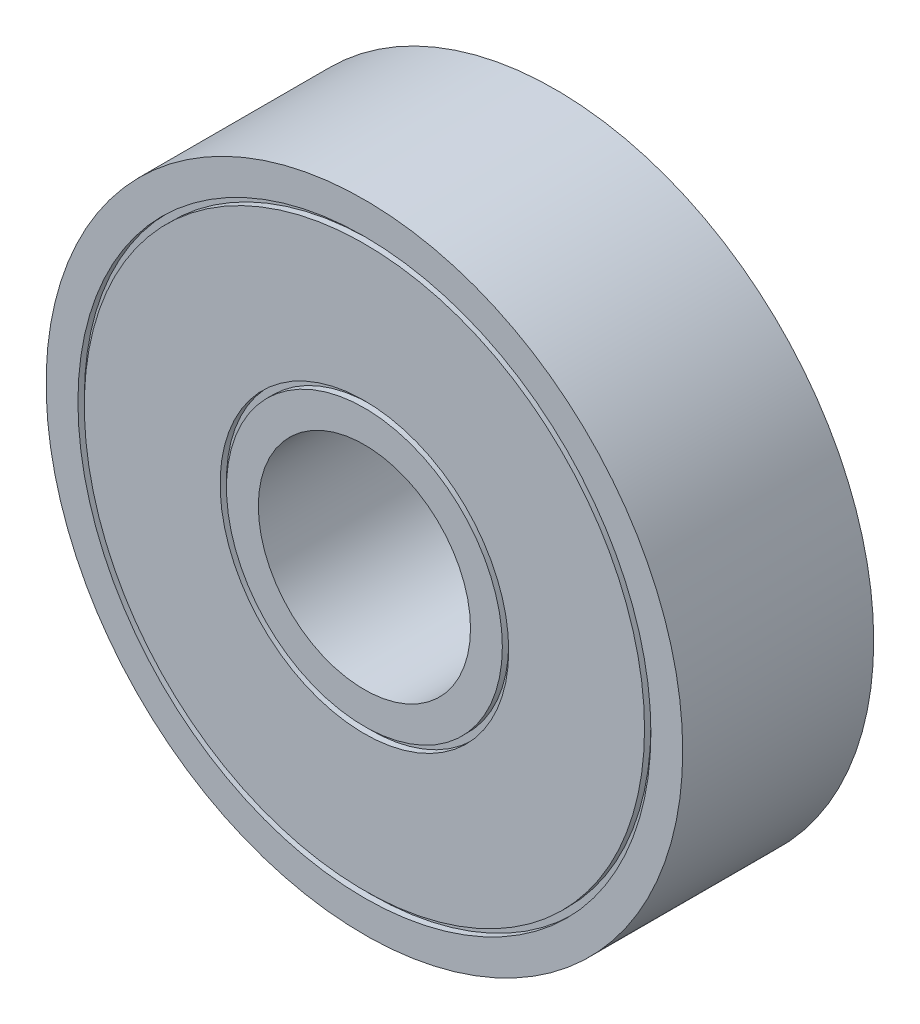
ISO-10303-21;
HEADER;
FILE_DESCRIPTION(('STEP AP214'),'2;1');
FILE_NAME('part.step','',(''),(''),'','','');
FILE_SCHEMA(('AUTOMOTIVE_DESIGN { 1 0 10303 214 1 1 1 1 }'));
ENDSEC;
DATA;
#1=APPLICATION_CONTEXT('core data for automotive mechanical design processes');
#2=APPLICATION_PROTOCOL_DEFINITION('international standard','automotive_design',2000,#1);
#3=PRODUCT_CONTEXT('',#1,'mechanical');
#4=PRODUCT('Part','Part','',(#3));
#5=PRODUCT_RELATED_PRODUCT_CATEGORY('part','',(#4));
#6=PRODUCT_DEFINITION_FORMATION('','',#4);
#7=PRODUCT_DEFINITION_CONTEXT('part definition',#1,'design');
#8=PRODUCT_DEFINITION('design','',#6,#7);
#9=PRODUCT_DEFINITION_SHAPE('','',#8);
#10=(LENGTH_UNIT() NAMED_UNIT(*) SI_UNIT(.MILLI.,.METRE.));
#11=(NAMED_UNIT(*) PLANE_ANGLE_UNIT() SI_UNIT($,.RADIAN.));
#12=(NAMED_UNIT(*) SI_UNIT($,.STERADIAN.) SOLID_ANGLE_UNIT());
#13=UNCERTAINTY_MEASURE_WITH_UNIT(LENGTH_MEASURE(1.E-05),#10,'distance_accuracy_value','');
#14=(GEOMETRIC_REPRESENTATION_CONTEXT(3) GLOBAL_UNCERTAINTY_ASSIGNED_CONTEXT((#13)) GLOBAL_UNIT_ASSIGNED_CONTEXT((#10,
#11,#12)) REPRESENTATION_CONTEXT('',''));
#15=CARTESIAN_POINT('',(0.,0.,0.));
#16=DIRECTION('',(0.,0.,1.));
#17=DIRECTION('',(1.,0.,0.));
#18=AXIS2_PLACEMENT_3D('',#15,#16,#17);
#19=CARTESIAN_POINT('',(0.,0.,0.));
#20=DIRECTION('',(0.,0.,1.));
#21=DIRECTION('',(1.,0.,0.));
#22=AXIS2_PLACEMENT_3D('',#19,#20,#21);
#23=PLANE('',#22);
#24=CARTESIAN_POINT('',(0.,0.,0.));
#25=DIRECTION('',(0.,0.,1.));
#26=DIRECTION('',(1.,0.,0.));
#27=AXIS2_PLACEMENT_3D('',#24,#25,#26);
#28=CIRCLE('',#27,5.);
#29=CARTESIAN_POINT('',(5.,0.,0.));
#30=VERTEX_POINT('',#29);
#31=EDGE_CURVE('E57',#30,#30,#28,.T.);
#32=ORIENTED_EDGE('',*,*,#31,.T.);
#33=EDGE_LOOP('',(#32));
#34=FACE_BOUND('',#33,.T.);
#35=CARTESIAN_POINT('',(0.,0.,0.));
#36=DIRECTION('',(0.,0.,1.));
#37=DIRECTION('',(1.,0.,0.));
#38=AXIS2_PLACEMENT_3D('',#35,#36,#37);
#39=CIRCLE('',#38,6.5);
#40=CARTESIAN_POINT('',(6.5,0.,0.));
#41=VERTEX_POINT('',#40);
#42=EDGE_CURVE('E103',#41,#41,#39,.T.);
#43=ORIENTED_EDGE('',*,*,#42,.F.);
#44=EDGE_LOOP('',(#43));
#45=FACE_BOUND('',#44,.T.);
#46=ADVANCED_FACE('F44',(#34,#45),#23,.F.);
#47=CARTESIAN_POINT('',(0.,0.,0.));
#48=DIRECTION('',(0.,0.,1.));
#49=DIRECTION('',(1.,0.,0.));
#50=AXIS2_PLACEMENT_3D('',#47,#48,#49);
#51=CIRCLE('',#50,6.8);
#52=CARTESIAN_POINT('',(6.8,0.,0.));
#53=VERTEX_POINT('',#52);
#54=EDGE_CURVE('E99',#53,#53,#51,.T.);
#55=ORIENTED_EDGE('',*,*,#54,.T.);
#56=EDGE_LOOP('',(#55));
#57=FACE_BOUND('',#56,.T.);
#58=CARTESIAN_POINT('',(0.,0.,0.));
#59=DIRECTION('',(0.,0.,1.));
#60=DIRECTION('',(1.,0.,0.));
#61=AXIS2_PLACEMENT_3D('',#58,#59,#60);
#62=CIRCLE('',#61,13.2);
#63=CARTESIAN_POINT('',(13.2,0.,0.));
#64=VERTEX_POINT('',#63);
#65=EDGE_CURVE('E91',#64,#64,#62,.T.);
#66=ORIENTED_EDGE('',*,*,#65,.F.);
#67=EDGE_LOOP('',(#66));
#68=FACE_BOUND('',#67,.T.);
#69=ADVANCED_FACE('F123',(#57,#68),#23,.F.);
#70=CARTESIAN_POINT('',(0.,0.,9.));
#71=DIRECTION('',(0.,0.,1.));
#72=DIRECTION('',(1.,0.,0.));
#73=AXIS2_PLACEMENT_3D('',#70,#71,#72);
#74=PLANE('',#73);
#75=CARTESIAN_POINT('',(0.,0.,9.));
#76=DIRECTION('',(0.,0.,1.));
#77=DIRECTION('',(1.,0.,0.));
#78=AXIS2_PLACEMENT_3D('',#75,#76,#77);
#79=CIRCLE('',#78,5.);
#80=CARTESIAN_POINT('',(5.,0.,9.));
#81=VERTEX_POINT('',#80);
#82=EDGE_CURVE('E55',#81,#81,#79,.T.);
#83=ORIENTED_EDGE('',*,*,#82,.F.);
#84=EDGE_LOOP('',(#83));
#85=FACE_BOUND('',#84,.T.);
#86=CARTESIAN_POINT('',(0.,0.,9.));
#87=DIRECTION('',(0.,0.,1.));
#88=DIRECTION('',(1.,0.,0.));
#89=AXIS2_PLACEMENT_3D('',#86,#87,#88);
#90=CIRCLE('',#89,6.5);
#91=CARTESIAN_POINT('',(6.5,0.,9.));
#92=VERTEX_POINT('',#91);
#93=EDGE_CURVE('E79',#92,#92,#90,.T.);
#94=ORIENTED_EDGE('',*,*,#93,.T.);
#95=EDGE_LOOP('',(#94));
#96=FACE_BOUND('',#95,.T.);
#97=ADVANCED_FACE('F129',(#85,#96),#74,.T.);
#98=CARTESIAN_POINT('',(0.,0.,9.));
#99=DIRECTION('',(0.,0.,1.));
#100=DIRECTION('',(1.,0.,0.));
#101=AXIS2_PLACEMENT_3D('',#98,#99,#100);
#102=CIRCLE('',#101,6.8);
#103=CARTESIAN_POINT('',(6.8,0.,9.));
#104=VERTEX_POINT('',#103);
#105=EDGE_CURVE('E75',#104,#104,#102,.T.);
#106=ORIENTED_EDGE('',*,*,#105,.F.);
#107=EDGE_LOOP('',(#106));
#108=FACE_BOUND('',#107,.T.);
#109=CARTESIAN_POINT('',(0.,0.,9.));
#110=DIRECTION('',(0.,0.,1.));
#111=DIRECTION('',(1.,0.,0.));
#112=AXIS2_PLACEMENT_3D('',#109,#110,#111);
#113=CIRCLE('',#112,13.2);
#114=CARTESIAN_POINT('',(13.2,0.,9.));
#115=VERTEX_POINT('',#114);
#116=EDGE_CURVE('E67',#115,#115,#113,.T.);
#117=ORIENTED_EDGE('',*,*,#116,.T.);
#118=EDGE_LOOP('',(#117));
#119=FACE_BOUND('',#118,.T.);
#120=ADVANCED_FACE('F141',(#108,#119),#74,.T.);
#121=CARTESIAN_POINT('',(0.,0.,9.));
#122=DIRECTION('',(0.,0.,1.));
#123=DIRECTION('',(1.,0.,0.));
#124=AXIS2_PLACEMENT_3D('',#121,#122,#123);
#125=CIRCLE('',#124,13.5);
#126=CARTESIAN_POINT('',(13.5,0.,9.));
#127=VERTEX_POINT('',#126);
#128=EDGE_CURVE('E63',#127,#127,#125,.T.);
#129=ORIENTED_EDGE('',*,*,#128,.F.);
#130=EDGE_LOOP('',(#129));
#131=FACE_BOUND('',#130,.T.);
#132=CARTESIAN_POINT('',(0.,0.,9.));
#133=DIRECTION('',(0.,0.,1.));
#134=DIRECTION('',(1.,0.,0.));
#135=AXIS2_PLACEMENT_3D('',#132,#133,#134);
#136=CIRCLE('',#135,15.);
#137=CARTESIAN_POINT('',(15.,0.,9.));
#138=VERTEX_POINT('',#137);
#139=EDGE_CURVE('E11',#138,#138,#136,.T.);
#140=ORIENTED_EDGE('',*,*,#139,.T.);
#141=EDGE_LOOP('',(#140));
#142=FACE_BOUND('',#141,.T.);
#143=ADVANCED_FACE('F133',(#131,#142),#74,.T.);
#144=CARTESIAN_POINT('',(0.,0.,0.));
#145=DIRECTION('',(0.,0.,1.));
#146=DIRECTION('',(1.,0.,0.));
#147=AXIS2_PLACEMENT_3D('',#144,#145,#146);
#148=CIRCLE('',#147,13.5);
#149=CARTESIAN_POINT('',(13.5,0.,0.));
#150=VERTEX_POINT('',#149);
#151=EDGE_CURVE('E87',#150,#150,#148,.T.);
#152=ORIENTED_EDGE('',*,*,#151,.T.);
#153=EDGE_LOOP('',(#152));
#154=FACE_BOUND('',#153,.T.);
#155=CARTESIAN_POINT('',(0.,0.,0.));
#156=DIRECTION('',(0.,0.,1.));
#157=DIRECTION('',(1.,0.,0.));
#158=AXIS2_PLACEMENT_3D('',#155,#156,#157);
#159=CIRCLE('',#158,15.);
#160=CARTESIAN_POINT('',(15.,0.,0.));
#161=VERTEX_POINT('',#160);
#162=EDGE_CURVE('E48',#161,#161,#159,.T.);
#163=ORIENTED_EDGE('',*,*,#162,.F.);
#164=EDGE_LOOP('',(#163));
#165=FACE_BOUND('',#164,.T.);
#166=ADVANCED_FACE('F125',(#154,#165),#23,.F.);
#167=CARTESIAN_POINT('',(0.,0.,9.));
#168=DIRECTION('',(0.,0.,-1.));
#169=DIRECTION('',(-1.,0.,0.));
#170=AXIS2_PLACEMENT_3D('',#167,#168,#169);
#171=CYLINDRICAL_SURFACE('',#170,15.);
#172=ORIENTED_EDGE('',*,*,#139,.F.);
#173=EDGE_LOOP('',(#172));
#174=FACE_BOUND('',#173,.T.);
#175=ORIENTED_EDGE('',*,*,#162,.T.);
#176=EDGE_LOOP('',(#175));
#177=FACE_BOUND('',#176,.T.);
#178=ADVANCED_FACE('F46',(#174,#177),#171,.T.);
#179=CARTESIAN_POINT('',(0.,0.,9.));
#180=DIRECTION('',(0.,0.,-1.));
#181=DIRECTION('',(-1.,0.,0.));
#182=AXIS2_PLACEMENT_3D('',#179,#180,#181);
#183=CYLINDRICAL_SURFACE('',#182,5.);
#184=ORIENTED_EDGE('',*,*,#82,.T.);
#185=EDGE_LOOP('',(#184));
#186=FACE_BOUND('',#185,.T.);
#187=ORIENTED_EDGE('',*,*,#31,.F.);
#188=EDGE_LOOP('',(#187));
#189=FACE_BOUND('',#188,.T.);
#190=ADVANCED_FACE('F139',(#186,#189),#183,.F.);
#191=CARTESIAN_POINT('',(0.,0.,8.7));
#192=DIRECTION('',(0.,0.,1.));
#193=DIRECTION('',(1.,0.,0.));
#194=AXIS2_PLACEMENT_3D('',#191,#192,#193);
#195=CYLINDRICAL_SURFACE('',#194,13.2);
#196=CARTESIAN_POINT('',(0.,0.,8.7));
#197=DIRECTION('',(0.,0.,1.));
#198=DIRECTION('',(1.,0.,0.));
#199=AXIS2_PLACEMENT_3D('',#196,#197,#198);
#200=CIRCLE('',#199,13.2);
#201=CARTESIAN_POINT('',(13.2,0.,8.7));
#202=VERTEX_POINT('',#201);
#203=EDGE_CURVE('E66',#202,#202,#200,.T.);
#204=ORIENTED_EDGE('',*,*,#203,.T.);
#205=EDGE_LOOP('',(#204));
#206=FACE_BOUND('',#205,.T.);
#207=ORIENTED_EDGE('',*,*,#116,.F.);
#208=EDGE_LOOP('',(#207));
#209=FACE_BOUND('',#208,.T.);
#210=ADVANCED_FACE('F181',(#206,#209),#195,.T.);
#211=CARTESIAN_POINT('',(0.,0.,8.7));
#212=DIRECTION('',(0.,0.,1.));
#213=DIRECTION('',(1.,0.,0.));
#214=AXIS2_PLACEMENT_3D('',#211,#212,#213);
#215=CYLINDRICAL_SURFACE('',#214,13.5);
#216=CARTESIAN_POINT('',(0.,0.,8.7));
#217=DIRECTION('',(0.,0.,1.));
#218=DIRECTION('',(1.,0.,0.));
#219=AXIS2_PLACEMENT_3D('',#216,#217,#218);
#220=CIRCLE('',#219,13.5);
#221=CARTESIAN_POINT('',(13.5,0.,8.7));
#222=VERTEX_POINT('',#221);
#223=EDGE_CURVE('E60',#222,#222,#220,.T.);
#224=ORIENTED_EDGE('',*,*,#223,.F.);
#225=EDGE_LOOP('',(#224));
#226=FACE_BOUND('',#225,.T.);
#227=ORIENTED_EDGE('',*,*,#128,.T.);
#228=EDGE_LOOP('',(#227));
#229=FACE_BOUND('',#228,.T.);
#230=ADVANCED_FACE('F177',(#226,#229),#215,.F.);
#231=CARTESIAN_POINT('',(0.,0.,8.7));
#232=DIRECTION('',(0.,0.,1.));
#233=DIRECTION('',(1.,0.,0.));
#234=AXIS2_PLACEMENT_3D('',#231,#232,#233);
#235=PLANE('',#234);
#236=ORIENTED_EDGE('',*,*,#203,.F.);
#237=EDGE_LOOP('',(#236));
#238=FACE_BOUND('',#237,.T.);
#239=ORIENTED_EDGE('',*,*,#223,.T.);
#240=EDGE_LOOP('',(#239));
#241=FACE_BOUND('',#240,.T.);
#242=ADVANCED_FACE('F173',(#238,#241),#235,.T.);
#243=CARTESIAN_POINT('',(0.,0.,8.7));
#244=DIRECTION('',(0.,0.,1.));
#245=DIRECTION('',(1.,0.,0.));
#246=AXIS2_PLACEMENT_3D('',#243,#244,#245);
#247=CYLINDRICAL_SURFACE('',#246,6.5);
#248=CARTESIAN_POINT('',(0.,0.,8.7));
#249=DIRECTION('',(0.,0.,1.));
#250=DIRECTION('',(1.,0.,0.));
#251=AXIS2_PLACEMENT_3D('',#248,#249,#250);
#252=CIRCLE('',#251,6.5);
#253=CARTESIAN_POINT('',(6.5,0.,8.7));
#254=VERTEX_POINT('',#253);
#255=EDGE_CURVE('E78',#254,#254,#252,.T.);
#256=ORIENTED_EDGE('',*,*,#255,.T.);
#257=EDGE_LOOP('',(#256));
#258=FACE_BOUND('',#257,.T.);
#259=ORIENTED_EDGE('',*,*,#93,.F.);
#260=EDGE_LOOP('',(#259));
#261=FACE_BOUND('',#260,.T.);
#262=ADVANCED_FACE('F169',(#258,#261),#247,.T.);
#263=CARTESIAN_POINT('',(0.,0.,8.7));
#264=DIRECTION('',(0.,0.,1.));
#265=DIRECTION('',(1.,0.,0.));
#266=AXIS2_PLACEMENT_3D('',#263,#264,#265);
#267=CYLINDRICAL_SURFACE('',#266,6.8);
#268=CARTESIAN_POINT('',(0.,0.,8.7));
#269=DIRECTION('',(0.,0.,1.));
#270=DIRECTION('',(1.,0.,0.));
#271=AXIS2_PLACEMENT_3D('',#268,#269,#270);
#272=CIRCLE('',#271,6.8);
#273=CARTESIAN_POINT('',(6.8,0.,8.7));
#274=VERTEX_POINT('',#273);
#275=EDGE_CURVE('E70',#274,#274,#272,.T.);
#276=ORIENTED_EDGE('',*,*,#275,.F.);
#277=EDGE_LOOP('',(#276));
#278=FACE_BOUND('',#277,.T.);
#279=ORIENTED_EDGE('',*,*,#105,.T.);
#280=EDGE_LOOP('',(#279));
#281=FACE_BOUND('',#280,.T.);
#282=ADVANCED_FACE('F165',(#278,#281),#267,.F.);
#283=CARTESIAN_POINT('',(0.,0.,8.7));
#284=DIRECTION('',(0.,0.,1.));
#285=DIRECTION('',(1.,0.,0.));
#286=AXIS2_PLACEMENT_3D('',#283,#284,#285);
#287=PLANE('',#286);
#288=ORIENTED_EDGE('',*,*,#255,.F.);
#289=EDGE_LOOP('',(#288));
#290=FACE_BOUND('',#289,.T.);
#291=ORIENTED_EDGE('',*,*,#275,.T.);
#292=EDGE_LOOP('',(#291));
#293=FACE_BOUND('',#292,.T.);
#294=ADVANCED_FACE('F159',(#290,#293),#287,.T.);
#295=CARTESIAN_POINT('',(0.,0.,0.3));
#296=DIRECTION('',(0.,0.,-1.));
#297=DIRECTION('',(-1.,0.,0.));
#298=AXIS2_PLACEMENT_3D('',#295,#296,#297);
#299=CYLINDRICAL_SURFACE('',#298,13.2);
#300=CARTESIAN_POINT('',(0.,0.,0.3));
#301=DIRECTION('',(0.,0.,1.));
#302=DIRECTION('',(1.,0.,0.));
#303=AXIS2_PLACEMENT_3D('',#300,#301,#302);
#304=CIRCLE('',#303,13.2);
#305=CARTESIAN_POINT('',(13.2,0.,0.3));
#306=VERTEX_POINT('',#305);
#307=EDGE_CURVE('E90',#306,#306,#304,.T.);
#308=ORIENTED_EDGE('',*,*,#307,.F.);
#309=EDGE_LOOP('',(#308));
#310=FACE_BOUND('',#309,.T.);
#311=ORIENTED_EDGE('',*,*,#65,.T.);
#312=EDGE_LOOP('',(#311));
#313=FACE_BOUND('',#312,.T.);
#314=ADVANCED_FACE('F150',(#310,#313),#299,.T.);
#315=CARTESIAN_POINT('',(0.,0.,0.3));
#316=DIRECTION('',(0.,0.,-1.));
#317=DIRECTION('',(-1.,0.,0.));
#318=AXIS2_PLACEMENT_3D('',#315,#316,#317);
#319=CYLINDRICAL_SURFACE('',#318,13.5);
#320=CARTESIAN_POINT('',(0.,0.,0.3));
#321=DIRECTION('',(0.,0.,1.));
#322=DIRECTION('',(1.,0.,0.));
#323=AXIS2_PLACEMENT_3D('',#320,#321,#322);
#324=CIRCLE('',#323,13.5);
#325=CARTESIAN_POINT('',(13.5,0.,0.3));
#326=VERTEX_POINT('',#325);
#327=EDGE_CURVE('E82',#326,#326,#324,.T.);
#328=ORIENTED_EDGE('',*,*,#327,.T.);
#329=EDGE_LOOP('',(#328));
#330=FACE_BOUND('',#329,.T.);
#331=ORIENTED_EDGE('',*,*,#151,.F.);
#332=EDGE_LOOP('',(#331));
#333=FACE_BOUND('',#332,.T.);
#334=ADVANCED_FACE('F148',(#330,#333),#319,.F.);
#335=CARTESIAN_POINT('',(0.,0.,0.3));
#336=DIRECTION('',(0.,0.,-1.));
#337=DIRECTION('',(1.,0.,0.));
#338=AXIS2_PLACEMENT_3D('',#335,#336,#337);
#339=PLANE('',#338);
#340=ORIENTED_EDGE('',*,*,#307,.T.);
#341=EDGE_LOOP('',(#340));
#342=FACE_BOUND('',#341,.T.);
#343=ORIENTED_EDGE('',*,*,#327,.F.);
#344=EDGE_LOOP('',(#343));
#345=FACE_BOUND('',#344,.T.);
#346=ADVANCED_FACE('F118',(#342,#345),#339,.T.);
#347=CARTESIAN_POINT('',(0.,0.,0.3));
#348=DIRECTION('',(0.,0.,-1.));
#349=DIRECTION('',(-1.,0.,0.));
#350=AXIS2_PLACEMENT_3D('',#347,#348,#349);
#351=CYLINDRICAL_SURFACE('',#350,6.5);
#352=CARTESIAN_POINT('',(0.,0.,0.3));
#353=DIRECTION('',(0.,0.,1.));
#354=DIRECTION('',(1.,0.,0.));
#355=AXIS2_PLACEMENT_3D('',#352,#353,#354);
#356=CIRCLE('',#355,6.5);
#357=CARTESIAN_POINT('',(6.5,0.,0.3));
#358=VERTEX_POINT('',#357);
#359=EDGE_CURVE('E102',#358,#358,#356,.T.);
#360=ORIENTED_EDGE('',*,*,#359,.F.);
#361=EDGE_LOOP('',(#360));
#362=FACE_BOUND('',#361,.T.);
#363=ORIENTED_EDGE('',*,*,#42,.T.);
#364=EDGE_LOOP('',(#363));
#365=FACE_BOUND('',#364,.T.);
#366=ADVANCED_FACE('F114',(#362,#365),#351,.T.);
#367=CARTESIAN_POINT('',(0.,0.,0.3));
#368=DIRECTION('',(0.,0.,-1.));
#369=DIRECTION('',(-1.,0.,0.));
#370=AXIS2_PLACEMENT_3D('',#367,#368,#369);
#371=CYLINDRICAL_SURFACE('',#370,6.8);
#372=CARTESIAN_POINT('',(0.,0.,0.3));
#373=DIRECTION('',(0.,0.,1.));
#374=DIRECTION('',(1.,0.,0.));
#375=AXIS2_PLACEMENT_3D('',#372,#373,#374);
#376=CIRCLE('',#375,6.8);
#377=CARTESIAN_POINT('',(6.8,0.,0.3));
#378=VERTEX_POINT('',#377);
#379=EDGE_CURVE('E94',#378,#378,#376,.T.);
#380=ORIENTED_EDGE('',*,*,#379,.T.);
#381=EDGE_LOOP('',(#380));
#382=FACE_BOUND('',#381,.T.);
#383=ORIENTED_EDGE('',*,*,#54,.F.);
#384=EDGE_LOOP('',(#383));
#385=FACE_BOUND('',#384,.T.);
#386=ADVANCED_FACE('F117',(#382,#385),#371,.F.);
#387=CARTESIAN_POINT('',(0.,0.,0.3));
#388=DIRECTION('',(0.,0.,-1.));
#389=DIRECTION('',(1.,0.,0.));
#390=AXIS2_PLACEMENT_3D('',#387,#388,#389);
#391=PLANE('',#390);
#392=ORIENTED_EDGE('',*,*,#359,.T.);
#393=EDGE_LOOP('',(#392));
#394=FACE_BOUND('',#393,.T.);
#395=ORIENTED_EDGE('',*,*,#379,.F.);
#396=EDGE_LOOP('',(#395));
#397=FACE_BOUND('',#396,.T.);
#398=ADVANCED_FACE('F111',(#394,#397),#391,.T.);
#399=CLOSED_SHELL('',(#46,#69,#97,#120,#143,#166,#178,#190,#210,#230,#242,#262,#282,#294,#314,
#334,#346,#366,#386,#398));
#400=MANIFOLD_SOLID_BREP('B2',#399);
#401=ADVANCED_BREP_SHAPE_REPRESENTATION('',(#18,#400),#14);
#402=SHAPE_DEFINITION_REPRESENTATION(#9,#401);
ENDSEC;
END-ISO-10303-21;
